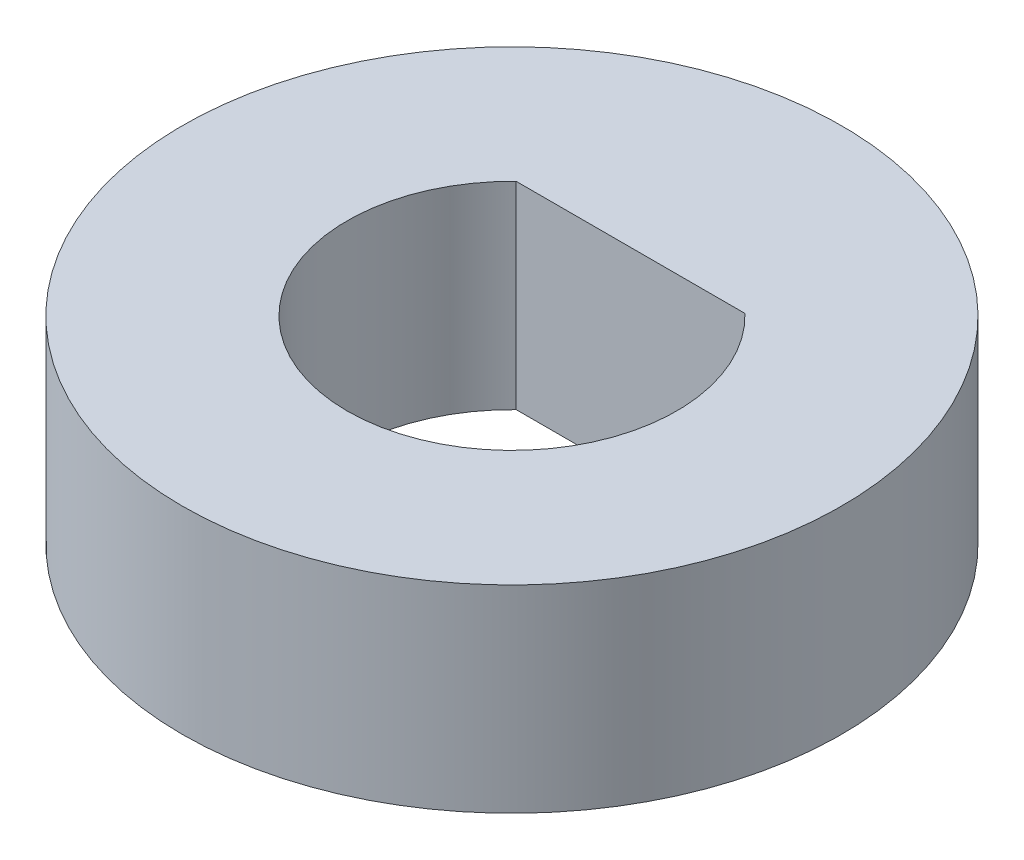
ISO-10303-21;
HEADER;
FILE_DESCRIPTION(('STEP AP214'),'2;1');
FILE_NAME('part.step','',(''),(''),'','','');
FILE_SCHEMA(('AUTOMOTIVE_DESIGN { 1 0 10303 214 1 1 1 1 }'));
ENDSEC;
DATA;
#1=APPLICATION_CONTEXT('core data for automotive mechanical design processes');
#2=APPLICATION_PROTOCOL_DEFINITION('international standard','automotive_design',2000,#1);
#3=PRODUCT_CONTEXT('',#1,'mechanical');
#4=PRODUCT('Part','Part','',(#3));
#5=PRODUCT_RELATED_PRODUCT_CATEGORY('part','',(#4));
#6=PRODUCT_DEFINITION_FORMATION('','',#4);
#7=PRODUCT_DEFINITION_CONTEXT('part definition',#1,'design');
#8=PRODUCT_DEFINITION('design','',#6,#7);
#9=PRODUCT_DEFINITION_SHAPE('','',#8);
#10=(LENGTH_UNIT() NAMED_UNIT(*) SI_UNIT(.MILLI.,.METRE.));
#11=(NAMED_UNIT(*) PLANE_ANGLE_UNIT() SI_UNIT($,.RADIAN.));
#12=(NAMED_UNIT(*) SI_UNIT($,.STERADIAN.) SOLID_ANGLE_UNIT());
#13=UNCERTAINTY_MEASURE_WITH_UNIT(LENGTH_MEASURE(1.E-05),#10,'distance_accuracy_value','');
#14=(GEOMETRIC_REPRESENTATION_CONTEXT(3) GLOBAL_UNCERTAINTY_ASSIGNED_CONTEXT((#13)) GLOBAL_UNIT_ASSIGNED_CONTEXT((#10,
#11,#12)) REPRESENTATION_CONTEXT('',''));
#15=CARTESIAN_POINT('',(0.,0.,0.));
#16=DIRECTION('',(0.,0.,1.));
#17=DIRECTION('',(1.,0.,0.));
#18=AXIS2_PLACEMENT_3D('',#15,#16,#17);
#19=CARTESIAN_POINT('',(0.,6.,0.));
#20=DIRECTION('',(0.,1.,0.));
#21=DIRECTION('',(0.,0.,1.));
#22=AXIS2_PLACEMENT_3D('',#19,#20,#21);
#23=PLANE('',#22);
#24=CARTESIAN_POINT('',(0.,6.,0.));
#25=DIRECTION('',(0.,1.,0.));
#26=DIRECTION('',(0.,0.,1.));
#27=AXIS2_PLACEMENT_3D('',#24,#25,#26);
#28=CIRCLE('',#27,10.);
#29=CARTESIAN_POINT('',(0.,6.,10.));
#30=VERTEX_POINT('',#29);
#31=EDGE_CURVE('E11',#30,#30,#28,.T.);
#32=ORIENTED_EDGE('',*,*,#31,.T.);
#33=EDGE_LOOP('',(#32));
#34=FACE_BOUND('',#33,.T.);
#35=DIRECTION('',(-1.,0.,0.));
#36=VECTOR('',#35,1.);
#37=CARTESIAN_POINT('',(-3.46987031457949,6.,-3.6));
#38=LINE('',#37,#36);
#39=CARTESIAN_POINT('',(3.46987031457949,6.,-3.6));
#40=VERTEX_POINT('',#39);
#41=CARTESIAN_POINT('',(-3.46987031457949,6.,-3.6));
#42=VERTEX_POINT('',#41);
#43=EDGE_CURVE('E85',#40,#42,#38,.T.);
#44=ORIENTED_EDGE('',*,*,#43,.F.);
#45=CARTESIAN_POINT('',(0.,6.,0.));
#46=DIRECTION('',(0.,1.,0.));
#47=DIRECTION('',(0.,0.,1.));
#48=AXIS2_PLACEMENT_3D('',#45,#46,#47);
#49=CIRCLE('',#48,5.);
#50=EDGE_CURVE('E72',#42,#40,#49,.T.);
#51=ORIENTED_EDGE('',*,*,#50,.F.);
#52=EDGE_LOOP('',(#44,#51));
#53=FACE_BOUND('',#52,.T.);
#54=ADVANCED_FACE('F38',(#34,#53),#23,.T.);
#55=CARTESIAN_POINT('',(0.,0.,0.));
#56=DIRECTION('',(0.,1.,0.));
#57=DIRECTION('',(0.,0.,1.));
#58=AXIS2_PLACEMENT_3D('',#55,#56,#57);
#59=PLANE('',#58);
#60=CARTESIAN_POINT('',(0.,0.,0.));
#61=DIRECTION('',(0.,1.,0.));
#62=DIRECTION('',(0.,0.,1.));
#63=AXIS2_PLACEMENT_3D('',#60,#61,#62);
#64=CIRCLE('',#63,10.);
#65=CARTESIAN_POINT('',(0.,0.,10.));
#66=VERTEX_POINT('',#65);
#67=EDGE_CURVE('E42',#66,#66,#64,.T.);
#68=ORIENTED_EDGE('',*,*,#67,.F.);
#69=EDGE_LOOP('',(#68));
#70=FACE_BOUND('',#69,.T.);
#71=CARTESIAN_POINT('',(0.,0.,0.));
#72=DIRECTION('',(0.,1.,0.));
#73=DIRECTION('',(0.,0.,1.));
#74=AXIS2_PLACEMENT_3D('',#71,#72,#73);
#75=CIRCLE('',#74,5.);
#76=CARTESIAN_POINT('',(-3.46987031457949,0.,-3.6));
#77=VERTEX_POINT('',#76);
#78=CARTESIAN_POINT('',(3.46987031457949,0.,-3.6));
#79=VERTEX_POINT('',#78);
#80=EDGE_CURVE('E61',#77,#79,#75,.T.);
#81=ORIENTED_EDGE('',*,*,#80,.T.);
#82=DIRECTION('',(-1.,0.,0.));
#83=VECTOR('',#82,1.);
#84=CARTESIAN_POINT('',(-3.46987031457949,0.,-3.6));
#85=LINE('',#84,#83);
#86=EDGE_CURVE('E67',#79,#77,#85,.T.);
#87=ORIENTED_EDGE('',*,*,#86,.T.);
#88=EDGE_LOOP('',(#81,#87));
#89=FACE_BOUND('',#88,.T.);
#90=ADVANCED_FACE('F79',(#70,#89),#59,.F.);
#91=CARTESIAN_POINT('',(0.,6.,0.));
#92=DIRECTION('',(0.,-1.,0.));
#93=DIRECTION('',(0.,0.,-1.));
#94=AXIS2_PLACEMENT_3D('',#91,#92,#93);
#95=CYLINDRICAL_SURFACE('',#94,10.);
#96=ORIENTED_EDGE('',*,*,#31,.F.);
#97=EDGE_LOOP('',(#96));
#98=FACE_BOUND('',#97,.T.);
#99=ORIENTED_EDGE('',*,*,#67,.T.);
#100=EDGE_LOOP('',(#99));
#101=FACE_BOUND('',#100,.T.);
#102=ADVANCED_FACE('F40',(#98,#101),#95,.T.);
#103=CARTESIAN_POINT('',(0.,6.,0.));
#104=DIRECTION('',(0.,-1.,0.));
#105=DIRECTION('',(0.,0.,-1.));
#106=AXIS2_PLACEMENT_3D('',#103,#104,#105);
#107=CYLINDRICAL_SURFACE('',#106,5.);
#108=ORIENTED_EDGE('',*,*,#80,.F.);
#109=DIRECTION('',(0.,-1.,0.));
#110=VECTOR('',#109,1.);
#111=CARTESIAN_POINT('',(-3.46987031457949,6.,-3.6));
#112=LINE('',#111,#110);
#113=EDGE_CURVE('E69',#42,#77,#112,.T.);
#114=ORIENTED_EDGE('',*,*,#113,.F.);
#115=ORIENTED_EDGE('',*,*,#50,.T.);
#116=DIRECTION('',(0.,-1.,0.));
#117=VECTOR('',#116,1.);
#118=CARTESIAN_POINT('',(3.46987031457949,6.,-3.6));
#119=LINE('',#118,#117);
#120=EDGE_CURVE('E54',#40,#79,#119,.T.);
#121=ORIENTED_EDGE('',*,*,#120,.T.);
#122=EDGE_LOOP('',(#108,#114,#115,#121));
#123=FACE_BOUND('',#122,.T.);
#124=ADVANCED_FACE('F74',(#123),#107,.F.);
#125=CARTESIAN_POINT('',(-3.46987031457949,6.,-3.6));
#126=DIRECTION('',(0.,0.,1.));
#127=DIRECTION('',(1.,0.,0.));
#128=AXIS2_PLACEMENT_3D('',#125,#126,#127);
#129=PLANE('',#128);
#130=ORIENTED_EDGE('',*,*,#86,.F.);
#131=ORIENTED_EDGE('',*,*,#120,.F.);
#132=ORIENTED_EDGE('',*,*,#43,.T.);
#133=ORIENTED_EDGE('',*,*,#113,.T.);
#134=EDGE_LOOP('',(#130,#131,#132,#133));
#135=FACE_BOUND('',#134,.T.);
#136=ADVANCED_FACE('F68',(#135),#129,.T.);
#137=CLOSED_SHELL('',(#54,#90,#102,#124,#136));
#138=MANIFOLD_SOLID_BREP('B2',#137);
#139=ADVANCED_BREP_SHAPE_REPRESENTATION('',(#18,#138),#14);
#140=SHAPE_DEFINITION_REPRESENTATION(#9,#139);
ENDSEC;
END-ISO-10303-21;
